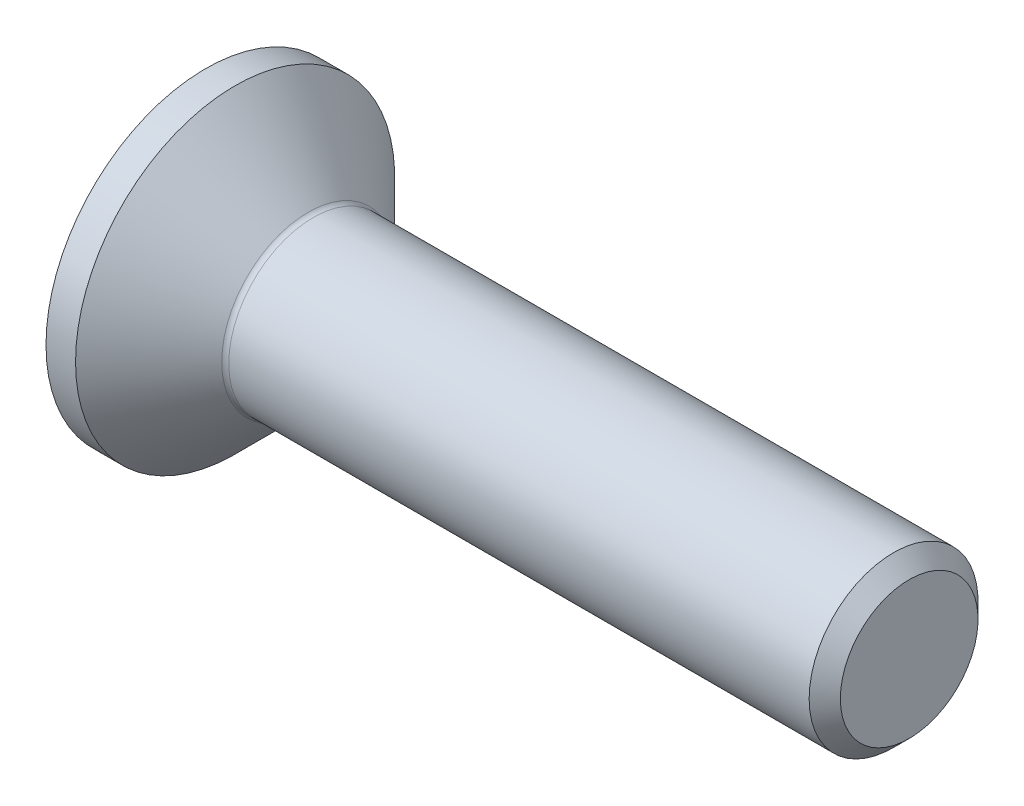
ISO-10303-21;
HEADER;
FILE_DESCRIPTION(('STEP AP214'),'2;1');
FILE_NAME('part.step','',(''),(''),'','','');
FILE_SCHEMA(('AUTOMOTIVE_DESIGN { 1 0 10303 214 1 1 1 1 }'));
ENDSEC;
DATA;
#1=APPLICATION_CONTEXT('core data for automotive mechanical design processes');
#2=APPLICATION_PROTOCOL_DEFINITION('international standard','automotive_design',2000,#1);
#3=PRODUCT_CONTEXT('',#1,'mechanical');
#4=PRODUCT('Part','Part','',(#3));
#5=PRODUCT_RELATED_PRODUCT_CATEGORY('part','',(#4));
#6=PRODUCT_DEFINITION_FORMATION('','',#4);
#7=PRODUCT_DEFINITION_CONTEXT('part definition',#1,'design');
#8=PRODUCT_DEFINITION('design','',#6,#7);
#9=PRODUCT_DEFINITION_SHAPE('','',#8);
#10=(LENGTH_UNIT() NAMED_UNIT(*) SI_UNIT(.MILLI.,.METRE.));
#11=(NAMED_UNIT(*) PLANE_ANGLE_UNIT() SI_UNIT($,.RADIAN.));
#12=(NAMED_UNIT(*) SI_UNIT($,.STERADIAN.) SOLID_ANGLE_UNIT());
#13=UNCERTAINTY_MEASURE_WITH_UNIT(LENGTH_MEASURE(1.E-05),#10,'distance_accuracy_value','');
#14=(GEOMETRIC_REPRESENTATION_CONTEXT(3) GLOBAL_UNCERTAINTY_ASSIGNED_CONTEXT((#13)) GLOBAL_UNIT_ASSIGNED_CONTEXT((#10,
#11,#12)) REPRESENTATION_CONTEXT('',''));
#15=CARTESIAN_POINT('',(0.,0.,0.));
#16=DIRECTION('',(0.,0.,1.));
#17=DIRECTION('',(1.,0.,0.));
#18=AXIS2_PLACEMENT_3D('',#15,#16,#17);
#19=CARTESIAN_POINT('',(0.,0.,0.));
#20=DIRECTION('',(-1.,0.,0.));
#21=DIRECTION('',(0.,0.,1.));
#22=AXIS2_PLACEMENT_3D('',#19,#20,#21);
#23=PLANE('',#22);
#24=CARTESIAN_POINT('',(0.,0.,0.));
#25=DIRECTION('',(-1.,0.,0.));
#26=DIRECTION('',(0.,0.,1.));
#27=AXIS2_PLACEMENT_3D('',#24,#25,#26);
#28=CIRCLE('',#27,5.67);
#29=CARTESIAN_POINT('',(0.,0.,5.67));
#30=VERTEX_POINT('',#29);
#31=EDGE_CURVE('E157',#30,#30,#28,.T.);
#32=ORIENTED_EDGE('',*,*,#31,.T.);
#33=EDGE_LOOP('',(#32));
#34=FACE_BOUND('',#33,.T.);
#35=DIRECTION('',(0.,-0.5,-0.866025403784439));
#36=VECTOR('',#35,1.);
#37=CARTESIAN_POINT('',(0.,-1.15470053837925,2.));
#38=LINE('',#37,#36);
#39=CARTESIAN_POINT('',(0.,-1.15470053837925,2.));
#40=VERTEX_POINT('',#39);
#41=CARTESIAN_POINT('',(0.,-2.3094010767585,0.));
#42=VERTEX_POINT('',#41);
#43=EDGE_CURVE('E119',#40,#42,#38,.T.);
#44=ORIENTED_EDGE('',*,*,#43,.T.);
#45=DIRECTION('',(0.,0.5,-0.866025403784439));
#46=VECTOR('',#45,1.);
#47=CARTESIAN_POINT('',(0.,-2.3094010767585,0.));
#48=LINE('',#47,#46);
#49=CARTESIAN_POINT('',(0.,-1.15470053837925,-2.));
#50=VERTEX_POINT('',#49);
#51=EDGE_CURVE('E49',#42,#50,#48,.T.);
#52=ORIENTED_EDGE('',*,*,#51,.T.);
#53=DIRECTION('',(0.,1.,0.));
#54=VECTOR('',#53,1.);
#55=CARTESIAN_POINT('',(0.,-1.15470053837925,-2.));
#56=LINE('',#55,#54);
#57=CARTESIAN_POINT('',(0.,1.15470053837925,-2.));
#58=VERTEX_POINT('',#57);
#59=EDGE_CURVE('E134',#50,#58,#56,.T.);
#60=ORIENTED_EDGE('',*,*,#59,.T.);
#61=DIRECTION('',(0.,0.5,0.866025403784439));
#62=VECTOR('',#61,1.);
#63=CARTESIAN_POINT('',(0.,1.15470053837925,-2.));
#64=LINE('',#63,#62);
#65=CARTESIAN_POINT('',(0.,2.3094010767585,0.));
#66=VERTEX_POINT('',#65);
#67=EDGE_CURVE('E270',#58,#66,#64,.T.);
#68=ORIENTED_EDGE('',*,*,#67,.T.);
#69=DIRECTION('',(0.,-0.5,0.866025403784439));
#70=VECTOR('',#69,1.);
#71=CARTESIAN_POINT('',(0.,2.3094010767585,0.));
#72=LINE('',#71,#70);
#73=CARTESIAN_POINT('',(0.,1.15470053837925,2.));
#74=VERTEX_POINT('',#73);
#75=EDGE_CURVE('E273',#66,#74,#72,.T.);
#76=ORIENTED_EDGE('',*,*,#75,.T.);
#77=DIRECTION('',(0.,-1.,0.));
#78=VECTOR('',#77,1.);
#79=CARTESIAN_POINT('',(0.,1.15470053837925,2.));
#80=LINE('',#79,#78);
#81=EDGE_CURVE('E276',#74,#40,#80,.T.);
#82=ORIENTED_EDGE('',*,*,#81,.T.);
#83=EDGE_LOOP('',(#44,#52,#60,#68,#76,#82));
#84=FACE_BOUND('',#83,.T.);
#85=ADVANCED_FACE('F34',(#34,#84),#23,.T.);
#86=CARTESIAN_POINT('',(0.,0.,0.));
#87=DIRECTION('',(-1.,0.,0.));
#88=DIRECTION('',(0.,0.,1.));
#89=AXIS2_PLACEMENT_3D('',#86,#87,#88);
#90=CYLINDRICAL_SURFACE('',#89,5.67);
#91=CARTESIAN_POINT('',(1.05000000000001,0.,0.));
#92=DIRECTION('',(-1.,0.,0.));
#93=DIRECTION('',(0.,0.,1.));
#94=AXIS2_PLACEMENT_3D('',#91,#92,#93);
#95=CIRCLE('',#94,5.67);
#96=CARTESIAN_POINT('',(1.05000000000001,0.,5.67));
#97=VERTEX_POINT('',#96);
#98=EDGE_CURVE('E154',#97,#97,#95,.T.);
#99=ORIENTED_EDGE('',*,*,#98,.T.);
#100=EDGE_LOOP('',(#99));
#101=FACE_BOUND('',#100,.T.);
#102=ORIENTED_EDGE('',*,*,#31,.F.);
#103=EDGE_LOOP('',(#102));
#104=FACE_BOUND('',#103,.T.);
#105=ADVANCED_FACE('F178',(#101,#104),#90,.T.);
#106=CARTESIAN_POINT('',(1.05000000000001,0.,0.));
#107=DIRECTION('',(-1.,0.,0.));
#108=DIRECTION('',(0.,0.,1.));
#109=AXIS2_PLACEMENT_3D('',#106,#107,#108);
#110=CONICAL_SURFACE('',#109,5.67,0.78539816339745);
#111=CARTESIAN_POINT('',(3.64677669529671,0.,0.));
#112=DIRECTION('',(-1.,0.,0.));
#113=DIRECTION('',(0.,0.,1.));
#114=AXIS2_PLACEMENT_3D('',#111,#112,#113);
#115=CIRCLE('',#114,3.0732233047033);
#116=CARTESIAN_POINT('',(3.64677669529671,0.,3.0732233047033));
#117=VERTEX_POINT('',#116);
#118=EDGE_CURVE('E42',#117,#117,#115,.T.);
#119=ORIENTED_EDGE('',*,*,#118,.T.);
#120=EDGE_LOOP('',(#119));
#121=FACE_BOUND('',#120,.T.);
#122=ORIENTED_EDGE('',*,*,#98,.F.);
#123=EDGE_LOOP('',(#122));
#124=FACE_BOUND('',#123,.T.);
#125=ADVANCED_FACE('F162',(#121,#124),#110,.T.);
#126=CARTESIAN_POINT('',(0.,0.,0.));
#127=DIRECTION('',(-1.,0.,0.));
#128=DIRECTION('',(0.,0.,1.));
#129=AXIS2_PLACEMENT_3D('',#126,#127,#128);
#130=CYLINDRICAL_SURFACE('',#129,2.99999999999993);
#131=CARTESIAN_POINT('',(3.82355339059334,0.,0.));
#132=DIRECTION('',(-1.,0.,0.));
#133=DIRECTION('',(0.,0.,1.));
#134=AXIS2_PLACEMENT_3D('',#131,#132,#133);
#135=CIRCLE('',#134,2.99999999999993);
#136=CARTESIAN_POINT('',(3.82355339059334,0.,2.99999999999993));
#137=VERTEX_POINT('',#136);
#138=EDGE_CURVE('E11',#137,#137,#135,.F.);
#139=ORIENTED_EDGE('',*,*,#138,.T.);
#140=EDGE_LOOP('',(#139));
#141=FACE_BOUND('',#140,.T.);
#142=CARTESIAN_POINT('',(24.4454999999999,0.,0.));
#143=DIRECTION('',(-1.,0.,0.));
#144=DIRECTION('',(0.,0.,1.));
#145=AXIS2_PLACEMENT_3D('',#142,#143,#144);
#146=CIRCLE('',#145,2.99999999999986);
#147=CARTESIAN_POINT('',(24.4454999999999,0.,2.99999999999986));
#148=VERTEX_POINT('',#147);
#149=EDGE_CURVE('E151',#148,#148,#146,.T.);
#150=ORIENTED_EDGE('',*,*,#149,.T.);
#151=EDGE_LOOP('',(#150));
#152=FACE_BOUND('',#151,.T.);
#153=ADVANCED_FACE('F189',(#141,#152),#130,.T.);
#154=CARTESIAN_POINT('',(25.,0.,0.));
#155=DIRECTION('',(-1.,0.,0.));
#156=DIRECTION('',(0.,0.,1.));
#157=AXIS2_PLACEMENT_3D('',#154,#155,#156);
#158=CONICAL_SURFACE('',#157,2.4455,0.785398163397225);
#159=ORIENTED_EDGE('',*,*,#149,.F.);
#160=EDGE_LOOP('',(#159));
#161=FACE_BOUND('',#160,.T.);
#162=CARTESIAN_POINT('',(25.,0.,0.));
#163=DIRECTION('',(-1.,0.,0.));
#164=DIRECTION('',(0.,0.,1.));
#165=AXIS2_PLACEMENT_3D('',#162,#163,#164);
#166=CIRCLE('',#165,2.4455);
#167=CARTESIAN_POINT('',(25.,0.,2.4455));
#168=VERTEX_POINT('',#167);
#169=EDGE_CURVE('E147',#168,#168,#166,.T.);
#170=ORIENTED_EDGE('',*,*,#169,.T.);
#171=EDGE_LOOP('',(#170));
#172=FACE_BOUND('',#171,.T.);
#173=ADVANCED_FACE('F173',(#161,#172),#158,.T.);
#174=CARTESIAN_POINT('',(25.,2.4455,0.));
#175=DIRECTION('',(1.,0.,0.));
#176=DIRECTION('',(0.,0.,-1.));
#177=AXIS2_PLACEMENT_3D('',#174,#175,#176);
#178=PLANE('',#177);
#179=ORIENTED_EDGE('',*,*,#169,.F.);
#180=EDGE_LOOP('',(#179));
#181=FACE_BOUND('',#180,.T.);
#182=ADVANCED_FACE('F166',(#181),#178,.T.);
#183=CARTESIAN_POINT('',(3.82355339059334,0.,0.));
#184=DIRECTION('',(-1.,0.,0.));
#185=DIRECTION('',(0.,0.,1.));
#186=AXIS2_PLACEMENT_3D('',#183,#184,#185);
#187=TOROIDAL_SURFACE('',#186,3.24999999999993,0.25);
#188=ORIENTED_EDGE('',*,*,#138,.F.);
#189=EDGE_LOOP('',(#188));
#190=FACE_BOUND('',#189,.T.);
#191=ORIENTED_EDGE('',*,*,#118,.F.);
#192=EDGE_LOOP('',(#191));
#193=FACE_BOUND('',#192,.T.);
#194=ADVANCED_FACE('F36',(#190,#193),#187,.F.);
#195=CARTESIAN_POINT('',(2.2,-2.3094010767585,0.));
#196=DIRECTION('',(0.,0.866025403784438,0.5));
#197=DIRECTION('',(0.,-0.5,0.866025403784439));
#198=AXIS2_PLACEMENT_3D('',#195,#196,#197);
#199=PLANE('',#198);
#200=ORIENTED_EDGE('',*,*,#51,.F.);
#201=DIRECTION('',(-1.,0.,0.));
#202=VECTOR('',#201,1.);
#203=CARTESIAN_POINT('',(2.2,-2.3094010767585,0.));
#204=LINE('',#203,#202);
#205=CARTESIAN_POINT('',(2.2,-2.3094010767585,0.));
#206=VERTEX_POINT('',#205);
#207=EDGE_CURVE('E267',#206,#42,#204,.T.);
#208=ORIENTED_EDGE('',*,*,#207,.F.);
#209=DIRECTION('',(0.,0.5,-0.866025403784439));
#210=VECTOR('',#209,1.);
#211=CARTESIAN_POINT('',(2.2,-2.3094010767585,0.));
#212=LINE('',#211,#210);
#213=CARTESIAN_POINT('',(2.2,-1.73205080756888,-1.));
#214=VERTEX_POINT('',#213);
#215=EDGE_CURVE('E116',#206,#214,#212,.T.);
#216=ORIENTED_EDGE('',*,*,#215,.T.);
#217=CARTESIAN_POINT('',(2.2,-1.15470053837925,-2.));
#218=VERTEX_POINT('',#217);
#219=EDGE_CURVE('E110',#214,#218,#212,.T.);
#220=ORIENTED_EDGE('',*,*,#219,.T.);
#221=DIRECTION('',(-1.,0.,0.));
#222=VECTOR('',#221,1.);
#223=CARTESIAN_POINT('',(2.2,-1.15470053837925,-2.));
#224=LINE('',#223,#222);
#225=EDGE_CURVE('E114',#218,#50,#224,.T.);
#226=ORIENTED_EDGE('',*,*,#225,.T.);
#227=EDGE_LOOP('',(#200,#208,#216,#220,#226));
#228=FACE_BOUND('',#227,.T.);
#229=ADVANCED_FACE('F112',(#228),#199,.T.);
#230=CARTESIAN_POINT('',(2.2,-1.15470053837925,-2.));
#231=DIRECTION('',(0.,0.,1.));
#232=DIRECTION('',(1.,0.,0.));
#233=AXIS2_PLACEMENT_3D('',#230,#231,#232);
#234=PLANE('',#233);
#235=ORIENTED_EDGE('',*,*,#59,.F.);
#236=ORIENTED_EDGE('',*,*,#225,.F.);
#237=DIRECTION('',(0.,1.,0.));
#238=VECTOR('',#237,1.);
#239=CARTESIAN_POINT('',(2.2,-1.15470053837925,-2.));
#240=LINE('',#239,#238);
#241=CARTESIAN_POINT('',(2.2,0.,-2.));
#242=VERTEX_POINT('',#241);
#243=EDGE_CURVE('E122',#218,#242,#240,.T.);
#244=ORIENTED_EDGE('',*,*,#243,.T.);
#245=CARTESIAN_POINT('',(2.2,1.15470053837925,-2.));
#246=VERTEX_POINT('',#245);
#247=EDGE_CURVE('E129',#242,#246,#240,.T.);
#248=ORIENTED_EDGE('',*,*,#247,.T.);
#249=DIRECTION('',(-1.,0.,0.));
#250=VECTOR('',#249,1.);
#251=CARTESIAN_POINT('',(2.2,1.15470053837925,-2.));
#252=LINE('',#251,#250);
#253=EDGE_CURVE('E136',#246,#58,#252,.T.);
#254=ORIENTED_EDGE('',*,*,#253,.T.);
#255=EDGE_LOOP('',(#235,#236,#244,#248,#254));
#256=FACE_BOUND('',#255,.T.);
#257=ADVANCED_FACE('F131',(#256),#234,.T.);
#258=CARTESIAN_POINT('',(2.2,1.15470053837925,-2.));
#259=DIRECTION('',(0.,-0.866025403784439,0.5));
#260=DIRECTION('',(0.,-0.5,-0.866025403784439));
#261=AXIS2_PLACEMENT_3D('',#258,#259,#260);
#262=PLANE('',#261);
#263=ORIENTED_EDGE('',*,*,#67,.F.);
#264=ORIENTED_EDGE('',*,*,#253,.F.);
#265=DIRECTION('',(0.,0.5,0.866025403784439));
#266=VECTOR('',#265,1.);
#267=CARTESIAN_POINT('',(2.2,1.15470053837925,-2.));
#268=LINE('',#267,#266);
#269=CARTESIAN_POINT('',(2.2,1.73205080756888,-1.));
#270=VERTEX_POINT('',#269);
#271=EDGE_CURVE('E259',#246,#270,#268,.T.);
#272=ORIENTED_EDGE('',*,*,#271,.T.);
#273=CARTESIAN_POINT('',(2.2,2.3094010767585,0.));
#274=VERTEX_POINT('',#273);
#275=EDGE_CURVE('E128',#270,#274,#268,.T.);
#276=ORIENTED_EDGE('',*,*,#275,.T.);
#277=DIRECTION('',(-1.,0.,0.));
#278=VECTOR('',#277,1.);
#279=CARTESIAN_POINT('',(2.2,2.3094010767585,0.));
#280=LINE('',#279,#278);
#281=EDGE_CURVE('E142',#274,#66,#280,.T.);
#282=ORIENTED_EDGE('',*,*,#281,.T.);
#283=EDGE_LOOP('',(#263,#264,#272,#276,#282));
#284=FACE_BOUND('',#283,.T.);
#285=ADVANCED_FACE('F203',(#284),#262,.T.);
#286=CARTESIAN_POINT('',(2.2,2.3094010767585,0.));
#287=DIRECTION('',(0.,-0.866025403784439,-0.5));
#288=DIRECTION('',(0.,0.5,-0.866025403784439));
#289=AXIS2_PLACEMENT_3D('',#286,#287,#288);
#290=PLANE('',#289);
#291=ORIENTED_EDGE('',*,*,#75,.F.);
#292=ORIENTED_EDGE('',*,*,#281,.F.);
#293=DIRECTION('',(0.,-0.5,0.866025403784439));
#294=VECTOR('',#293,1.);
#295=CARTESIAN_POINT('',(2.2,2.3094010767585,0.));
#296=LINE('',#295,#294);
#297=CARTESIAN_POINT('',(2.2,1.73205080756888,1.));
#298=VERTEX_POINT('',#297);
#299=EDGE_CURVE('E57',#274,#298,#296,.T.);
#300=ORIENTED_EDGE('',*,*,#299,.T.);
#301=CARTESIAN_POINT('',(2.2,1.15470053837925,2.));
#302=VERTEX_POINT('',#301);
#303=EDGE_CURVE('E238',#298,#302,#296,.T.);
#304=ORIENTED_EDGE('',*,*,#303,.T.);
#305=DIRECTION('',(-1.,0.,0.));
#306=VECTOR('',#305,1.);
#307=CARTESIAN_POINT('',(2.2,1.15470053837925,2.));
#308=LINE('',#307,#306);
#309=EDGE_CURVE('E252',#302,#74,#308,.T.);
#310=ORIENTED_EDGE('',*,*,#309,.T.);
#311=EDGE_LOOP('',(#291,#292,#300,#304,#310));
#312=FACE_BOUND('',#311,.T.);
#313=ADVANCED_FACE('F206',(#312),#290,.T.);
#314=CARTESIAN_POINT('',(2.2,1.15470053837925,2.));
#315=DIRECTION('',(0.,0.,-1.));
#316=DIRECTION('',(-1.,0.,0.));
#317=AXIS2_PLACEMENT_3D('',#314,#315,#316);
#318=PLANE('',#317);
#319=ORIENTED_EDGE('',*,*,#81,.F.);
#320=ORIENTED_EDGE('',*,*,#309,.F.);
#321=DIRECTION('',(0.,-1.,0.));
#322=VECTOR('',#321,1.);
#323=CARTESIAN_POINT('',(2.2,1.15470053837925,2.));
#324=LINE('',#323,#322);
#325=CARTESIAN_POINT('',(2.2,0.,2.));
#326=VERTEX_POINT('',#325);
#327=EDGE_CURVE('E237',#302,#326,#324,.T.);
#328=ORIENTED_EDGE('',*,*,#327,.T.);
#329=CARTESIAN_POINT('',(2.2,-1.15470053837925,2.));
#330=VERTEX_POINT('',#329);
#331=EDGE_CURVE('E243',#326,#330,#324,.T.);
#332=ORIENTED_EDGE('',*,*,#331,.T.);
#333=DIRECTION('',(-1.,0.,0.));
#334=VECTOR('',#333,1.);
#335=CARTESIAN_POINT('',(2.2,-1.15470053837925,2.));
#336=LINE('',#335,#334);
#337=EDGE_CURVE('E282',#330,#40,#336,.T.);
#338=ORIENTED_EDGE('',*,*,#337,.T.);
#339=EDGE_LOOP('',(#319,#320,#328,#332,#338));
#340=FACE_BOUND('',#339,.T.);
#341=ADVANCED_FACE('F210',(#340),#318,.T.);
#342=CARTESIAN_POINT('',(2.2,-1.15470053837925,2.));
#343=DIRECTION('',(0.,0.866025403784438,-0.5));
#344=DIRECTION('',(0.,0.5,0.866025403784439));
#345=AXIS2_PLACEMENT_3D('',#342,#343,#344);
#346=PLANE('',#345);
#347=ORIENTED_EDGE('',*,*,#43,.F.);
#348=ORIENTED_EDGE('',*,*,#337,.F.);
#349=DIRECTION('',(0.,-0.5,-0.866025403784439));
#350=VECTOR('',#349,1.);
#351=CARTESIAN_POINT('',(2.2,-1.15470053837925,2.));
#352=LINE('',#351,#350);
#353=CARTESIAN_POINT('',(2.2,-1.73205080756888,1.));
#354=VERTEX_POINT('',#353);
#355=EDGE_CURVE('E246',#330,#354,#352,.T.);
#356=ORIENTED_EDGE('',*,*,#355,.T.);
#357=EDGE_CURVE('E253',#354,#206,#352,.T.);
#358=ORIENTED_EDGE('',*,*,#357,.T.);
#359=ORIENTED_EDGE('',*,*,#207,.T.);
#360=EDGE_LOOP('',(#347,#348,#356,#358,#359));
#361=FACE_BOUND('',#360,.T.);
#362=ADVANCED_FACE('F213',(#361),#346,.T.);
#363=CARTESIAN_POINT('',(2.2,-2.3094010767585,0.));
#364=DIRECTION('',(-1.,0.,0.));
#365=DIRECTION('',(0.,0.,1.));
#366=AXIS2_PLACEMENT_3D('',#363,#364,#365);
#367=PLANE('',#366);
#368=CARTESIAN_POINT('',(2.2,0.,0.));
#369=DIRECTION('',(-1.,0.,0.));
#370=DIRECTION('',(0.,0.,1.));
#371=AXIS2_PLACEMENT_3D('',#368,#369,#370);
#372=CIRCLE('',#371,2.);
#373=EDGE_CURVE('E135',#354,#326,#372,.T.);
#374=ORIENTED_EDGE('',*,*,#373,.F.);
#375=ORIENTED_EDGE('',*,*,#355,.F.);
#376=ORIENTED_EDGE('',*,*,#331,.F.);
#377=EDGE_LOOP('',(#374,#375,#376));
#378=FACE_BOUND('',#377,.T.);
#379=ADVANCED_FACE('F217',(#378),#367,.T.);
#380=EDGE_CURVE('E139',#214,#354,#372,.T.);
#381=ORIENTED_EDGE('',*,*,#380,.F.);
#382=ORIENTED_EDGE('',*,*,#215,.F.);
#383=ORIENTED_EDGE('',*,*,#357,.F.);
#384=EDGE_LOOP('',(#381,#382,#383));
#385=FACE_BOUND('',#384,.T.);
#386=ADVANCED_FACE('F220',(#385),#367,.T.);
#387=EDGE_CURVE('E124',#242,#214,#372,.T.);
#388=ORIENTED_EDGE('',*,*,#387,.F.);
#389=ORIENTED_EDGE('',*,*,#243,.F.);
#390=ORIENTED_EDGE('',*,*,#219,.F.);
#391=EDGE_LOOP('',(#388,#389,#390));
#392=FACE_BOUND('',#391,.T.);
#393=ADVANCED_FACE('F123',(#392),#367,.T.);
#394=EDGE_CURVE('E255',#270,#242,#372,.T.);
#395=ORIENTED_EDGE('',*,*,#394,.F.);
#396=ORIENTED_EDGE('',*,*,#271,.F.);
#397=ORIENTED_EDGE('',*,*,#247,.F.);
#398=EDGE_LOOP('',(#395,#396,#397));
#399=FACE_BOUND('',#398,.T.);
#400=ADVANCED_FACE('F232',(#399),#367,.T.);
#401=EDGE_CURVE('E148',#298,#270,#372,.T.);
#402=ORIENTED_EDGE('',*,*,#401,.F.);
#403=ORIENTED_EDGE('',*,*,#299,.F.);
#404=ORIENTED_EDGE('',*,*,#275,.F.);
#405=EDGE_LOOP('',(#402,#403,#404));
#406=FACE_BOUND('',#405,.T.);
#407=ADVANCED_FACE('F227',(#406),#367,.T.);
#408=EDGE_CURVE('E141',#326,#298,#372,.T.);
#409=ORIENTED_EDGE('',*,*,#408,.F.);
#410=ORIENTED_EDGE('',*,*,#327,.F.);
#411=ORIENTED_EDGE('',*,*,#303,.F.);
#412=EDGE_LOOP('',(#409,#410,#411));
#413=FACE_BOUND('',#412,.T.);
#414=ADVANCED_FACE('F198',(#413),#367,.T.);
#415=CARTESIAN_POINT('',(2.2,0.,0.));
#416=DIRECTION('',(-1.,0.,0.));
#417=DIRECTION('',(0.,0.,1.));
#418=AXIS2_PLACEMENT_3D('',#415,#416,#417);
#419=CONICAL_SURFACE('',#418,2.,1.04719755119659);
#420=CARTESIAN_POINT('',(3.35470053837926,0.,0.));
#421=VERTEX_POINT('',#420);
#422=VERTEX_LOOP('',#421);
#423=FACE_BOUND('',#422,.T.);
#424=ORIENTED_EDGE('',*,*,#408,.T.);
#425=ORIENTED_EDGE('',*,*,#401,.T.);
#426=ORIENTED_EDGE('',*,*,#394,.T.);
#427=ORIENTED_EDGE('',*,*,#387,.T.);
#428=ORIENTED_EDGE('',*,*,#380,.T.);
#429=ORIENTED_EDGE('',*,*,#373,.T.);
#430=EDGE_LOOP('',(#424,#425,#426,#427,#428,#429));
#431=FACE_BOUND('',#430,.T.);
#432=ADVANCED_FACE('F196',(#423,#431),#419,.F.);
#433=CLOSED_SHELL('',(#85,#105,#125,#153,#173,#182,#194,#229,#257,#285,#313,#341,#362,#379,#386,
#393,#400,#407,#414,#432));
#434=MANIFOLD_SOLID_BREP('B2',#433);
#435=ADVANCED_BREP_SHAPE_REPRESENTATION('',(#18,#434),#14);
#436=SHAPE_DEFINITION_REPRESENTATION(#9,#435);
ENDSEC;
END-ISO-10303-21;
